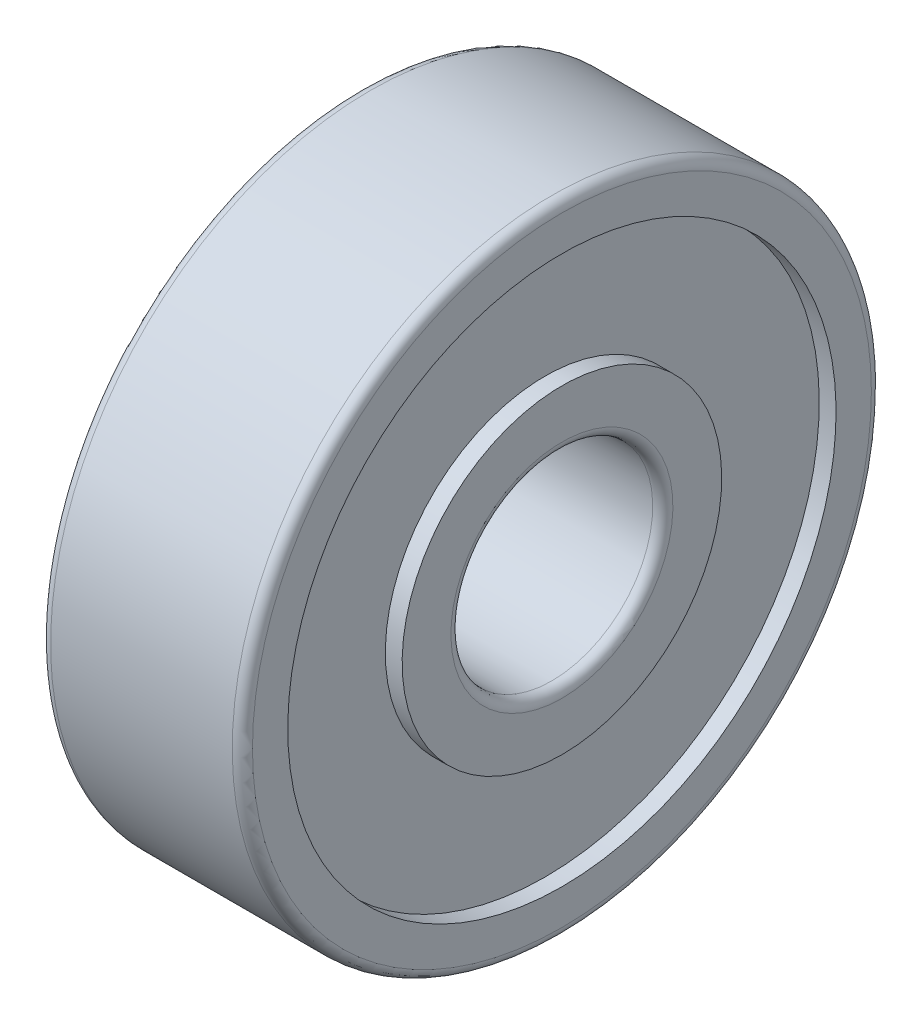
ISO-10303-21;
HEADER;
FILE_DESCRIPTION(('STEP AP214'),'2;1');
FILE_NAME('part.step','',(''),(''),'','','');
FILE_SCHEMA(('AUTOMOTIVE_DESIGN { 1 0 10303 214 1 1 1 1 }'));
ENDSEC;
DATA;
#1=APPLICATION_CONTEXT('core data for automotive mechanical design processes');
#2=APPLICATION_PROTOCOL_DEFINITION('international standard','automotive_design',2000,#1);
#3=PRODUCT_CONTEXT('',#1,'mechanical');
#4=PRODUCT('Part','Part','',(#3));
#5=PRODUCT_RELATED_PRODUCT_CATEGORY('part','',(#4));
#6=PRODUCT_DEFINITION_FORMATION('','',#4);
#7=PRODUCT_DEFINITION_CONTEXT('part definition',#1,'design');
#8=PRODUCT_DEFINITION('design','',#6,#7);
#9=PRODUCT_DEFINITION_SHAPE('','',#8);
#10=(LENGTH_UNIT() NAMED_UNIT(*) SI_UNIT(.MILLI.,.METRE.));
#11=(NAMED_UNIT(*) PLANE_ANGLE_UNIT() SI_UNIT($,.RADIAN.));
#12=(NAMED_UNIT(*) SI_UNIT($,.STERADIAN.) SOLID_ANGLE_UNIT());
#13=UNCERTAINTY_MEASURE_WITH_UNIT(LENGTH_MEASURE(1.E-05),#10,'distance_accuracy_value','');
#14=(GEOMETRIC_REPRESENTATION_CONTEXT(3) GLOBAL_UNCERTAINTY_ASSIGNED_CONTEXT((#13)) GLOBAL_UNIT_ASSIGNED_CONTEXT((#10,
#11,#12)) REPRESENTATION_CONTEXT('',''));
#15=CARTESIAN_POINT('',(0.,0.,0.));
#16=DIRECTION('',(0.,0.,1.));
#17=DIRECTION('',(1.,0.,0.));
#18=AXIS2_PLACEMENT_3D('',#15,#16,#17);
#19=CARTESIAN_POINT('',(0.,9.5,0.));
#20=DIRECTION('',(1.,0.,0.));
#21=DIRECTION('',(0.,1.,0.));
#22=AXIS2_PLACEMENT_3D('',#19,#20,#21);
#23=PLANE('',#22);
#24=CARTESIAN_POINT('',(0.,0.,0.));
#25=DIRECTION('',(1.,0.,0.));
#26=DIRECTION('',(0.,1.,0.));
#27=AXIS2_PLACEMENT_3D('',#24,#25,#26);
#28=CIRCLE('',#27,9.2);
#29=CARTESIAN_POINT('',(0.,9.2,0.));
#30=VERTEX_POINT('',#29);
#31=EDGE_CURVE('E57',#30,#30,#28,.F.);
#32=ORIENTED_EDGE('',*,*,#31,.T.);
#33=EDGE_LOOP('',(#32));
#34=FACE_BOUND('',#33,.T.);
#35=CARTESIAN_POINT('',(0.,0.,0.));
#36=DIRECTION('',(-1.,0.,0.));
#37=DIRECTION('',(0.,-1.,0.));
#38=AXIS2_PLACEMENT_3D('',#35,#36,#37);
#39=CIRCLE('',#38,8.15);
#40=CARTESIAN_POINT('',(0.,-8.15,0.));
#41=VERTEX_POINT('',#40);
#42=EDGE_CURVE('E69',#41,#41,#39,.T.);
#43=ORIENTED_EDGE('',*,*,#42,.F.);
#44=EDGE_LOOP('',(#43));
#45=FACE_BOUND('',#44,.T.);
#46=ADVANCED_FACE('F37',(#34,#45),#23,.F.);
#47=CARTESIAN_POINT('',(0.,0.,0.));
#48=DIRECTION('',(-1.,0.,0.));
#49=DIRECTION('',(0.,-1.,0.));
#50=AXIS2_PLACEMENT_3D('',#47,#48,#49);
#51=CYLINDRICAL_SURFACE('',#50,8.15);
#52=CARTESIAN_POINT('',(0.499999999999999,0.,0.));
#53=DIRECTION('',(-1.,0.,0.));
#54=DIRECTION('',(0.,-1.,0.));
#55=AXIS2_PLACEMENT_3D('',#52,#53,#54);
#56=CIRCLE('',#55,8.15);
#57=CARTESIAN_POINT('',(0.499999999999999,-8.15,0.));
#58=VERTEX_POINT('',#57);
#59=EDGE_CURVE('E72',#58,#58,#56,.T.);
#60=ORIENTED_EDGE('',*,*,#59,.F.);
#61=EDGE_LOOP('',(#60));
#62=FACE_BOUND('',#61,.T.);
#63=ORIENTED_EDGE('',*,*,#42,.T.);
#64=EDGE_LOOP('',(#63));
#65=FACE_BOUND('',#64,.T.);
#66=ADVANCED_FACE('F125',(#62,#65),#51,.F.);
#67=CARTESIAN_POINT('',(0.5,8.15,0.));
#68=DIRECTION('',(1.,0.,0.));
#69=DIRECTION('',(0.,1.,0.));
#70=AXIS2_PLACEMENT_3D('',#67,#68,#69);
#71=PLANE('',#70);
#72=CARTESIAN_POINT('',(0.5,0.,0.));
#73=DIRECTION('',(-1.,0.,0.));
#74=DIRECTION('',(0.,-1.,0.));
#75=AXIS2_PLACEMENT_3D('',#72,#73,#74);
#76=CIRCLE('',#75,4.75);
#77=CARTESIAN_POINT('',(0.5,-4.75,0.));
#78=VERTEX_POINT('',#77);
#79=EDGE_CURVE('E75',#78,#78,#76,.T.);
#80=ORIENTED_EDGE('',*,*,#79,.F.);
#81=EDGE_LOOP('',(#80));
#82=FACE_BOUND('',#81,.T.);
#83=ORIENTED_EDGE('',*,*,#59,.T.);
#84=EDGE_LOOP('',(#83));
#85=FACE_BOUND('',#84,.T.);
#86=ADVANCED_FACE('F131',(#82,#85),#71,.F.);
#87=CARTESIAN_POINT('',(0.,0.,0.));
#88=DIRECTION('',(-1.,0.,0.));
#89=DIRECTION('',(0.,-1.,0.));
#90=AXIS2_PLACEMENT_3D('',#87,#88,#89);
#91=CYLINDRICAL_SURFACE('',#90,4.75);
#92=CARTESIAN_POINT('',(0.,0.,0.));
#93=DIRECTION('',(-1.,0.,0.));
#94=DIRECTION('',(0.,-1.,0.));
#95=AXIS2_PLACEMENT_3D('',#92,#93,#94);
#96=CIRCLE('',#95,4.75);
#97=CARTESIAN_POINT('',(0.,-4.75,0.));
#98=VERTEX_POINT('',#97);
#99=EDGE_CURVE('E78',#98,#98,#96,.T.);
#100=ORIENTED_EDGE('',*,*,#99,.F.);
#101=EDGE_LOOP('',(#100));
#102=FACE_BOUND('',#101,.T.);
#103=ORIENTED_EDGE('',*,*,#79,.T.);
#104=EDGE_LOOP('',(#103));
#105=FACE_BOUND('',#104,.T.);
#106=ADVANCED_FACE('F188',(#102,#105),#91,.T.);
#107=CARTESIAN_POINT('',(0.,4.75,0.));
#108=DIRECTION('',(1.,0.,0.));
#109=DIRECTION('',(0.,1.,0.));
#110=AXIS2_PLACEMENT_3D('',#107,#108,#109);
#111=PLANE('',#110);
#112=CARTESIAN_POINT('',(0.,0.,0.));
#113=DIRECTION('',(1.,0.,0.));
#114=DIRECTION('',(0.,1.,0.));
#115=AXIS2_PLACEMENT_3D('',#112,#113,#114);
#116=CIRCLE('',#115,3.3);
#117=CARTESIAN_POINT('',(0.,3.3,0.));
#118=VERTEX_POINT('',#117);
#119=EDGE_CURVE('E10',#118,#118,#116,.T.);
#120=ORIENTED_EDGE('',*,*,#119,.T.);
#121=EDGE_LOOP('',(#120));
#122=FACE_BOUND('',#121,.T.);
#123=ORIENTED_EDGE('',*,*,#99,.T.);
#124=EDGE_LOOP('',(#123));
#125=FACE_BOUND('',#124,.T.);
#126=ADVANCED_FACE('F122',(#122,#125),#111,.F.);
#127=CARTESIAN_POINT('',(0.,0.,0.));
#128=DIRECTION('',(-1.,0.,0.));
#129=DIRECTION('',(0.,-1.,0.));
#130=AXIS2_PLACEMENT_3D('',#127,#128,#129);
#131=CYLINDRICAL_SURFACE('',#130,3.);
#132=CARTESIAN_POINT('',(5.7,0.,0.));
#133=DIRECTION('',(-1.,0.,0.));
#134=DIRECTION('',(0.,-1.,0.));
#135=AXIS2_PLACEMENT_3D('',#132,#133,#134);
#136=CIRCLE('',#135,3.);
#137=CARTESIAN_POINT('',(5.7,-3.,0.));
#138=VERTEX_POINT('',#137);
#139=EDGE_CURVE('E44',#138,#138,#136,.F.);
#140=ORIENTED_EDGE('',*,*,#139,.T.);
#141=EDGE_LOOP('',(#140));
#142=FACE_BOUND('',#141,.T.);
#143=CARTESIAN_POINT('',(0.3,0.,0.));
#144=DIRECTION('',(1.,0.,0.));
#145=DIRECTION('',(0.,1.,0.));
#146=AXIS2_PLACEMENT_3D('',#143,#144,#145);
#147=CIRCLE('',#146,3.);
#148=CARTESIAN_POINT('',(0.3,3.,0.));
#149=VERTEX_POINT('',#148);
#150=EDGE_CURVE('E48',#149,#149,#147,.F.);
#151=ORIENTED_EDGE('',*,*,#150,.T.);
#152=EDGE_LOOP('',(#151));
#153=FACE_BOUND('',#152,.T.);
#154=ADVANCED_FACE('F116',(#142,#153),#131,.F.);
#155=CARTESIAN_POINT('',(6.,4.75,0.));
#156=DIRECTION('',(-1.,0.,0.));
#157=DIRECTION('',(0.,-1.,0.));
#158=AXIS2_PLACEMENT_3D('',#155,#156,#157);
#159=PLANE('',#158);
#160=CARTESIAN_POINT('',(6.,0.,0.));
#161=DIRECTION('',(-1.,0.,0.));
#162=DIRECTION('',(0.,-1.,0.));
#163=AXIS2_PLACEMENT_3D('',#160,#161,#162);
#164=CIRCLE('',#163,3.3);
#165=CARTESIAN_POINT('',(6.,-3.3,0.));
#166=VERTEX_POINT('',#165);
#167=EDGE_CURVE('E52',#166,#166,#164,.T.);
#168=ORIENTED_EDGE('',*,*,#167,.T.);
#169=EDGE_LOOP('',(#168));
#170=FACE_BOUND('',#169,.T.);
#171=CARTESIAN_POINT('',(6.,0.,0.));
#172=DIRECTION('',(-1.,0.,0.));
#173=DIRECTION('',(0.,-1.,0.));
#174=AXIS2_PLACEMENT_3D('',#171,#172,#173);
#175=CIRCLE('',#174,4.75);
#176=CARTESIAN_POINT('',(6.,-4.75,0.));
#177=VERTEX_POINT('',#176);
#178=EDGE_CURVE('E81',#177,#177,#175,.T.);
#179=ORIENTED_EDGE('',*,*,#178,.F.);
#180=EDGE_LOOP('',(#179));
#181=FACE_BOUND('',#180,.T.);
#182=ADVANCED_FACE('F111',(#170,#181),#159,.F.);
#183=CARTESIAN_POINT('',(0.,0.,0.));
#184=DIRECTION('',(-1.,0.,0.));
#185=DIRECTION('',(0.,-1.,0.));
#186=AXIS2_PLACEMENT_3D('',#183,#184,#185);
#187=CYLINDRICAL_SURFACE('',#186,4.75);
#188=CARTESIAN_POINT('',(5.5,0.,0.));
#189=DIRECTION('',(-1.,0.,0.));
#190=DIRECTION('',(0.,-1.,0.));
#191=AXIS2_PLACEMENT_3D('',#188,#189,#190);
#192=CIRCLE('',#191,4.75);
#193=CARTESIAN_POINT('',(5.5,-4.75,0.));
#194=VERTEX_POINT('',#193);
#195=EDGE_CURVE('E84',#194,#194,#192,.T.);
#196=ORIENTED_EDGE('',*,*,#195,.F.);
#197=EDGE_LOOP('',(#196));
#198=FACE_BOUND('',#197,.T.);
#199=ORIENTED_EDGE('',*,*,#178,.T.);
#200=EDGE_LOOP('',(#199));
#201=FACE_BOUND('',#200,.T.);
#202=ADVANCED_FACE('F105',(#198,#201),#187,.T.);
#203=CARTESIAN_POINT('',(5.5,8.15,0.));
#204=DIRECTION('',(-1.,0.,0.));
#205=DIRECTION('',(0.,-1.,0.));
#206=AXIS2_PLACEMENT_3D('',#203,#204,#205);
#207=PLANE('',#206);
#208=CARTESIAN_POINT('',(5.5,0.,0.));
#209=DIRECTION('',(-1.,0.,0.));
#210=DIRECTION('',(0.,-1.,0.));
#211=AXIS2_PLACEMENT_3D('',#208,#209,#210);
#212=CIRCLE('',#211,8.15);
#213=CARTESIAN_POINT('',(5.5,-8.15,0.));
#214=VERTEX_POINT('',#213);
#215=EDGE_CURVE('E87',#214,#214,#212,.T.);
#216=ORIENTED_EDGE('',*,*,#215,.F.);
#217=EDGE_LOOP('',(#216));
#218=FACE_BOUND('',#217,.T.);
#219=ORIENTED_EDGE('',*,*,#195,.T.);
#220=EDGE_LOOP('',(#219));
#221=FACE_BOUND('',#220,.T.);
#222=ADVANCED_FACE('F99',(#218,#221),#207,.F.);
#223=CARTESIAN_POINT('',(0.,0.,0.));
#224=DIRECTION('',(-1.,0.,0.));
#225=DIRECTION('',(0.,-1.,0.));
#226=AXIS2_PLACEMENT_3D('',#223,#224,#225);
#227=CYLINDRICAL_SURFACE('',#226,8.15);
#228=CARTESIAN_POINT('',(6.,0.,0.));
#229=DIRECTION('',(-1.,0.,0.));
#230=DIRECTION('',(0.,-1.,0.));
#231=AXIS2_PLACEMENT_3D('',#228,#229,#230);
#232=CIRCLE('',#231,8.15);
#233=CARTESIAN_POINT('',(6.,-8.15,0.));
#234=VERTEX_POINT('',#233);
#235=EDGE_CURVE('E90',#234,#234,#232,.T.);
#236=ORIENTED_EDGE('',*,*,#235,.F.);
#237=EDGE_LOOP('',(#236));
#238=FACE_BOUND('',#237,.T.);
#239=ORIENTED_EDGE('',*,*,#215,.T.);
#240=EDGE_LOOP('',(#239));
#241=FACE_BOUND('',#240,.T.);
#242=ADVANCED_FACE('F96',(#238,#241),#227,.F.);
#243=CARTESIAN_POINT('',(6.,9.5,0.));
#244=DIRECTION('',(-1.,0.,0.));
#245=DIRECTION('',(0.,-1.,0.));
#246=AXIS2_PLACEMENT_3D('',#243,#244,#245);
#247=PLANE('',#246);
#248=CARTESIAN_POINT('',(6.,0.,0.));
#249=DIRECTION('',(-1.,0.,0.));
#250=DIRECTION('',(0.,-1.,0.));
#251=AXIS2_PLACEMENT_3D('',#248,#249,#250);
#252=CIRCLE('',#251,9.2);
#253=CARTESIAN_POINT('',(6.,-9.2,0.));
#254=VERTEX_POINT('',#253);
#255=EDGE_CURVE('E60',#254,#254,#252,.F.);
#256=ORIENTED_EDGE('',*,*,#255,.T.);
#257=EDGE_LOOP('',(#256));
#258=FACE_BOUND('',#257,.T.);
#259=ORIENTED_EDGE('',*,*,#235,.T.);
#260=EDGE_LOOP('',(#259));
#261=FACE_BOUND('',#260,.T.);
#262=ADVANCED_FACE('F94',(#258,#261),#247,.F.);
#263=CARTESIAN_POINT('',(0.,0.,0.));
#264=DIRECTION('',(-1.,0.,0.));
#265=DIRECTION('',(0.,-1.,0.));
#266=AXIS2_PLACEMENT_3D('',#263,#264,#265);
#267=CYLINDRICAL_SURFACE('',#266,9.5);
#268=CARTESIAN_POINT('',(5.7,0.,0.));
#269=DIRECTION('',(-1.,0.,0.));
#270=DIRECTION('',(0.,-1.,0.));
#271=AXIS2_PLACEMENT_3D('',#268,#269,#270);
#272=CIRCLE('',#271,9.5);
#273=CARTESIAN_POINT('',(5.7,-9.5,0.));
#274=VERTEX_POINT('',#273);
#275=EDGE_CURVE('E63',#274,#274,#272,.T.);
#276=ORIENTED_EDGE('',*,*,#275,.T.);
#277=EDGE_LOOP('',(#276));
#278=FACE_BOUND('',#277,.T.);
#279=CARTESIAN_POINT('',(0.299999999999999,0.,0.));
#280=DIRECTION('',(1.,0.,0.));
#281=DIRECTION('',(0.,1.,0.));
#282=AXIS2_PLACEMENT_3D('',#279,#280,#281);
#283=CIRCLE('',#282,9.5);
#284=CARTESIAN_POINT('',(0.299999999999999,9.5,0.));
#285=VERTEX_POINT('',#284);
#286=EDGE_CURVE('E66',#285,#285,#283,.T.);
#287=ORIENTED_EDGE('',*,*,#286,.T.);
#288=EDGE_LOOP('',(#287));
#289=FACE_BOUND('',#288,.T.);
#290=ADVANCED_FACE('F141',(#278,#289),#267,.T.);
#291=CARTESIAN_POINT('',(5.7,0.,0.));
#292=DIRECTION('',(-1.,0.,0.));
#293=DIRECTION('',(0.,-1.,0.));
#294=AXIS2_PLACEMENT_3D('',#291,#292,#293);
#295=TOROIDAL_SURFACE('',#294,9.2,0.3);
#296=ORIENTED_EDGE('',*,*,#255,.F.);
#297=EDGE_LOOP('',(#296));
#298=FACE_BOUND('',#297,.T.);
#299=ORIENTED_EDGE('',*,*,#275,.F.);
#300=EDGE_LOOP('',(#299));
#301=FACE_BOUND('',#300,.T.);
#302=ADVANCED_FACE('F137',(#298,#301),#295,.T.);
#303=CARTESIAN_POINT('',(0.299999999999999,0.,0.));
#304=DIRECTION('',(1.,0.,0.));
#305=DIRECTION('',(0.,1.,0.));
#306=AXIS2_PLACEMENT_3D('',#303,#304,#305);
#307=TOROIDAL_SURFACE('',#306,9.2,0.3);
#308=ORIENTED_EDGE('',*,*,#286,.F.);
#309=EDGE_LOOP('',(#308));
#310=FACE_BOUND('',#309,.T.);
#311=ORIENTED_EDGE('',*,*,#31,.F.);
#312=EDGE_LOOP('',(#311));
#313=FACE_BOUND('',#312,.T.);
#314=ADVANCED_FACE('F140',(#310,#313),#307,.T.);
#315=CARTESIAN_POINT('',(5.7,0.,0.));
#316=DIRECTION('',(-1.,0.,0.));
#317=DIRECTION('',(0.,-1.,0.));
#318=AXIS2_PLACEMENT_3D('',#315,#316,#317);
#319=TOROIDAL_SURFACE('',#318,3.3,0.3);
#320=ORIENTED_EDGE('',*,*,#139,.F.);
#321=EDGE_LOOP('',(#320));
#322=FACE_BOUND('',#321,.T.);
#323=ORIENTED_EDGE('',*,*,#167,.F.);
#324=EDGE_LOOP('',(#323));
#325=FACE_BOUND('',#324,.T.);
#326=ADVANCED_FACE('F144',(#322,#325),#319,.T.);
#327=CARTESIAN_POINT('',(0.3,0.,0.));
#328=DIRECTION('',(1.,0.,0.));
#329=DIRECTION('',(0.,1.,0.));
#330=AXIS2_PLACEMENT_3D('',#327,#328,#329);
#331=TOROIDAL_SURFACE('',#330,3.3,0.3);
#332=ORIENTED_EDGE('',*,*,#119,.F.);
#333=EDGE_LOOP('',(#332));
#334=FACE_BOUND('',#333,.T.);
#335=ORIENTED_EDGE('',*,*,#150,.F.);
#336=EDGE_LOOP('',(#335));
#337=FACE_BOUND('',#336,.T.);
#338=ADVANCED_FACE('F39',(#334,#337),#331,.T.);
#339=CLOSED_SHELL('',(#46,#66,#86,#106,#126,#154,#182,#202,#222,#242,#262,#290,#302,#314,#326,#338));
#340=MANIFOLD_SOLID_BREP('B2',#339);
#341=ADVANCED_BREP_SHAPE_REPRESENTATION('',(#18,#340),#14);
#342=SHAPE_DEFINITION_REPRESENTATION(#9,#341);
ENDSEC;
END-ISO-10303-21;
